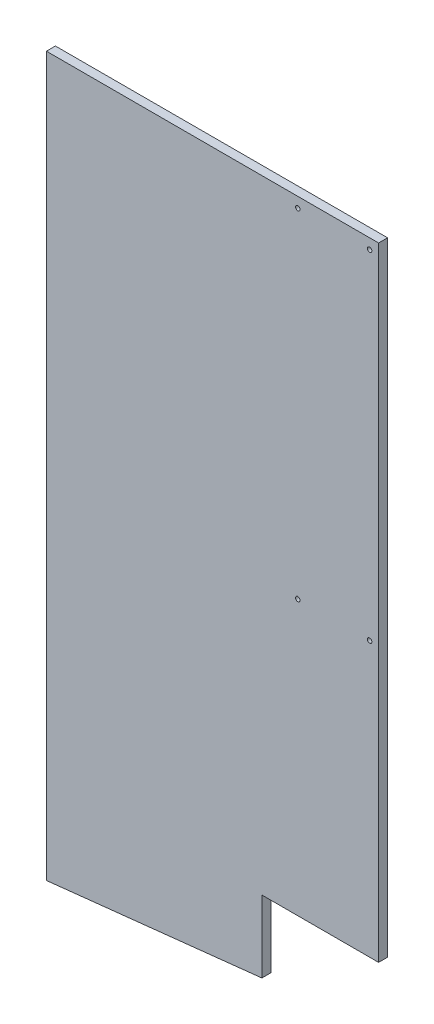
ISO-10303-21;
HEADER;
FILE_DESCRIPTION(('STEP AP214'),'2;1');
FILE_NAME('part.step','',(''),(''),'','','');
FILE_SCHEMA(('AUTOMOTIVE_DESIGN { 1 0 10303 214 1 1 1 1 }'));
ENDSEC;
DATA;
#1=APPLICATION_CONTEXT('core data for automotive mechanical design processes');
#2=APPLICATION_PROTOCOL_DEFINITION('international standard','automotive_design',2000,#1);
#3=PRODUCT_CONTEXT('',#1,'mechanical');
#4=PRODUCT('Part','Part','',(#3));
#5=PRODUCT_RELATED_PRODUCT_CATEGORY('part','',(#4));
#6=PRODUCT_DEFINITION_FORMATION('','',#4);
#7=PRODUCT_DEFINITION_CONTEXT('part definition',#1,'design');
#8=PRODUCT_DEFINITION('design','',#6,#7);
#9=PRODUCT_DEFINITION_SHAPE('','',#8);
#10=(LENGTH_UNIT() NAMED_UNIT(*) SI_UNIT(.MILLI.,.METRE.));
#11=(NAMED_UNIT(*) PLANE_ANGLE_UNIT() SI_UNIT($,.RADIAN.));
#12=(NAMED_UNIT(*) SI_UNIT($,.STERADIAN.) SOLID_ANGLE_UNIT());
#13=UNCERTAINTY_MEASURE_WITH_UNIT(LENGTH_MEASURE(1.E-05),#10,'distance_accuracy_value','');
#14=(GEOMETRIC_REPRESENTATION_CONTEXT(3) GLOBAL_UNCERTAINTY_ASSIGNED_CONTEXT((#13)) GLOBAL_UNIT_ASSIGNED_CONTEXT((#10,
#11,#12)) REPRESENTATION_CONTEXT('',''));
#15=CARTESIAN_POINT('',(0.,0.,0.));
#16=DIRECTION('',(0.,0.,1.));
#17=DIRECTION('',(1.,0.,0.));
#18=AXIS2_PLACEMENT_3D('',#15,#16,#17);
#19=CARTESIAN_POINT('',(234.95,0.,-6.35));
#20=DIRECTION('',(0.,0.,-1.));
#21=DIRECTION('',(-1.,0.,0.));
#22=AXIS2_PLACEMENT_3D('',#19,#20,#21);
#23=PLANE('',#22);
#24=CARTESIAN_POINT('',(177.8,261.2898,-6.35));
#25=DIRECTION('',(0.,0.,1.));
#26=DIRECTION('',(1.,0.,0.));
#27=AXIS2_PLACEMENT_3D('',#24,#25,#26);
#28=CIRCLE('',#27,1.5875);
#29=CARTESIAN_POINT('',(179.3875,261.2898,-6.35));
#30=VERTEX_POINT('',#29);
#31=EDGE_CURVE('E103',#30,#30,#28,.T.);
#32=ORIENTED_EDGE('',*,*,#31,.T.);
#33=EDGE_LOOP('',(#32));
#34=FACE_BOUND('',#33,.T.);
#35=CARTESIAN_POINT('',(228.6,261.2898,-6.35));
#36=DIRECTION('',(0.,0.,1.));
#37=DIRECTION('',(1.,0.,0.));
#38=AXIS2_PLACEMENT_3D('',#35,#36,#37);
#39=CIRCLE('',#38,1.5875);
#40=CARTESIAN_POINT('',(230.1875,261.2898,-6.35));
#41=VERTEX_POINT('',#40);
#42=EDGE_CURVE('E107',#41,#41,#39,.T.);
#43=ORIENTED_EDGE('',*,*,#42,.T.);
#44=EDGE_LOOP('',(#43));
#45=FACE_BOUND('',#44,.T.);
#46=CARTESIAN_POINT('',(177.8,500.7102,-6.35));
#47=DIRECTION('',(0.,0.,-1.));
#48=DIRECTION('',(-1.,0.,0.));
#49=AXIS2_PLACEMENT_3D('',#46,#47,#48);
#50=CIRCLE('',#49,1.5875);
#51=CARTESIAN_POINT('',(176.2125,500.7102,-6.35));
#52=VERTEX_POINT('',#51);
#53=EDGE_CURVE('E109',#52,#52,#50,.F.);
#54=ORIENTED_EDGE('',*,*,#53,.T.);
#55=EDGE_LOOP('',(#54));
#56=FACE_BOUND('',#55,.T.);
#57=CARTESIAN_POINT('',(228.6,500.7102,-6.35));
#58=DIRECTION('',(0.,0.,-1.));
#59=DIRECTION('',(-1.,0.,0.));
#60=AXIS2_PLACEMENT_3D('',#57,#58,#59);
#61=CIRCLE('',#60,1.5875);
#62=CARTESIAN_POINT('',(227.0125,500.7102,-6.35));
#63=VERTEX_POINT('',#62);
#64=EDGE_CURVE('E20',#63,#63,#61,.F.);
#65=ORIENTED_EDGE('',*,*,#64,.T.);
#66=EDGE_LOOP('',(#65));
#67=FACE_BOUND('',#66,.T.);
#68=DIRECTION('',(0.,1.,0.));
#69=VECTOR('',#68,1.);
#70=CARTESIAN_POINT('',(234.95,0.,-6.35));
#71=LINE('',#70,#69);
#72=CARTESIAN_POINT('',(234.95,67.31,-6.35));
#73=VERTEX_POINT('',#72);
#74=CARTESIAN_POINT('',(234.95,508.,-6.35));
#75=VERTEX_POINT('',#74);
#76=EDGE_CURVE('E73',#73,#75,#71,.T.);
#77=ORIENTED_EDGE('',*,*,#76,.F.);
#78=DIRECTION('',(1.,0.,0.));
#79=VECTOR('',#78,1.);
#80=CARTESIAN_POINT('',(234.95,67.31,-6.35));
#81=LINE('',#80,#79);
#82=CARTESIAN_POINT('',(152.4,67.31,-6.35));
#83=VERTEX_POINT('',#82);
#84=EDGE_CURVE('E116',#73,#83,#81,.F.);
#85=ORIENTED_EDGE('',*,*,#84,.T.);
#86=DIRECTION('',(0.,1.,0.));
#87=VECTOR('',#86,1.);
#88=CARTESIAN_POINT('',(152.4,67.31,-6.35));
#89=LINE('',#88,#87);
#90=CARTESIAN_POINT('',(152.4,16.4756756756745,-6.35));
#91=VERTEX_POINT('',#90);
#92=EDGE_CURVE('E125',#83,#91,#89,.F.);
#93=ORIENTED_EDGE('',*,*,#92,.T.);
#94=DIRECTION('',(-0.994207047565848,-0.107481842980105,0.));
#95=VECTOR('',#94,1.);
#96=CARTESIAN_POINT('',(234.95,25.4,-6.35));
#97=LINE('',#96,#95);
#98=CARTESIAN_POINT('',(0.,-7.89299181569447E-13,-6.35));
#99=VERTEX_POINT('',#98);
#100=EDGE_CURVE('E129',#91,#99,#97,.T.);
#101=ORIENTED_EDGE('',*,*,#100,.T.);
#102=DIRECTION('',(0.,1.,0.));
#103=VECTOR('',#102,1.);
#104=CARTESIAN_POINT('',(0.,0.,-6.35));
#105=LINE('',#104,#103);
#106=CARTESIAN_POINT('',(0.,508.,-6.35));
#107=VERTEX_POINT('',#106);
#108=EDGE_CURVE('E83',#107,#99,#105,.F.);
#109=ORIENTED_EDGE('',*,*,#108,.F.);
#110=DIRECTION('',(1.,0.,0.));
#111=VECTOR('',#110,1.);
#112=CARTESIAN_POINT('',(0.,508.,-6.35));
#113=LINE('',#112,#111);
#114=EDGE_CURVE('E68',#75,#107,#113,.F.);
#115=ORIENTED_EDGE('',*,*,#114,.F.);
#116=EDGE_LOOP('',(#77,#85,#93,#101,#109,#115));
#117=FACE_BOUND('',#116,.T.);
#118=ADVANCED_FACE('F17',(#34,#45,#56,#67,#117),#23,.T.);
#119=CARTESIAN_POINT('',(234.95,0.,0.));
#120=DIRECTION('',(1.,0.,0.));
#121=DIRECTION('',(0.,0.,-1.));
#122=AXIS2_PLACEMENT_3D('',#119,#120,#121);
#123=PLANE('',#122);
#124=DIRECTION('',(0.,1.,0.));
#125=VECTOR('',#124,1.);
#126=CARTESIAN_POINT('',(234.95,0.,0.));
#127=LINE('',#126,#125);
#128=CARTESIAN_POINT('',(234.95,67.31,0.));
#129=VERTEX_POINT('',#128);
#130=CARTESIAN_POINT('',(234.95,508.,0.));
#131=VERTEX_POINT('',#130);
#132=EDGE_CURVE('E106',#129,#131,#127,.T.);
#133=ORIENTED_EDGE('',*,*,#132,.F.);
#134=DIRECTION('',(0.,0.,1.));
#135=VECTOR('',#134,1.);
#136=CARTESIAN_POINT('',(234.95,67.31,0.));
#137=LINE('',#136,#135);
#138=EDGE_CURVE('E78',#129,#73,#137,.F.);
#139=ORIENTED_EDGE('',*,*,#138,.T.);
#140=ORIENTED_EDGE('',*,*,#76,.T.);
#141=DIRECTION('',(0.,0.,1.));
#142=VECTOR('',#141,1.);
#143=CARTESIAN_POINT('',(234.95,508.,0.));
#144=LINE('',#143,#142);
#145=EDGE_CURVE('E75',#131,#75,#144,.F.);
#146=ORIENTED_EDGE('',*,*,#145,.F.);
#147=EDGE_LOOP('',(#133,#139,#140,#146));
#148=FACE_BOUND('',#147,.T.);
#149=ADVANCED_FACE('F74',(#148),#123,.T.);
#150=CARTESIAN_POINT('',(0.,508.,0.));
#151=DIRECTION('',(0.,1.,0.));
#152=DIRECTION('',(0.,0.,1.));
#153=AXIS2_PLACEMENT_3D('',#150,#151,#152);
#154=PLANE('',#153);
#155=DIRECTION('',(0.,0.,1.));
#156=VECTOR('',#155,1.);
#157=CARTESIAN_POINT('',(0.,508.,-6.35));
#158=LINE('',#157,#156);
#159=CARTESIAN_POINT('',(0.,508.,0.));
#160=VERTEX_POINT('',#159);
#161=EDGE_CURVE('E85',#160,#107,#158,.F.);
#162=ORIENTED_EDGE('',*,*,#161,.F.);
#163=DIRECTION('',(1.,0.,0.));
#164=VECTOR('',#163,1.);
#165=CARTESIAN_POINT('',(0.,508.,0.));
#166=LINE('',#165,#164);
#167=EDGE_CURVE('E89',#131,#160,#166,.F.);
#168=ORIENTED_EDGE('',*,*,#167,.F.);
#169=ORIENTED_EDGE('',*,*,#145,.T.);
#170=ORIENTED_EDGE('',*,*,#114,.T.);
#171=EDGE_LOOP('',(#162,#168,#169,#170));
#172=FACE_BOUND('',#171,.T.);
#173=ADVANCED_FACE('F87',(#172),#154,.T.);
#174=CARTESIAN_POINT('',(0.,0.,-6.35));
#175=DIRECTION('',(-1.,0.,0.));
#176=DIRECTION('',(0.,0.,1.));
#177=AXIS2_PLACEMENT_3D('',#174,#175,#176);
#178=PLANE('',#177);
#179=ORIENTED_EDGE('',*,*,#108,.T.);
#180=DIRECTION('',(0.,0.,1.));
#181=VECTOR('',#180,1.);
#182=CARTESIAN_POINT('',(3.33066907387547E-13,-3.15719672627779E-12,0.));
#183=LINE('',#182,#181);
#184=CARTESIAN_POINT('',(0.,-7.89299181569447E-13,0.));
#185=VERTEX_POINT('',#184);
#186=EDGE_CURVE('E127',#99,#185,#183,.T.);
#187=ORIENTED_EDGE('',*,*,#186,.T.);
#188=DIRECTION('',(0.,1.,0.));
#189=VECTOR('',#188,1.);
#190=CARTESIAN_POINT('',(0.,0.,0.));
#191=LINE('',#190,#189);
#192=EDGE_CURVE('E136',#160,#185,#191,.F.);
#193=ORIENTED_EDGE('',*,*,#192,.F.);
#194=ORIENTED_EDGE('',*,*,#161,.T.);
#195=EDGE_LOOP('',(#179,#187,#193,#194));
#196=FACE_BOUND('',#195,.T.);
#197=ADVANCED_FACE('F133',(#196),#178,.T.);
#198=CARTESIAN_POINT('',(234.95,25.4,0.));
#199=DIRECTION('',(-0.107481842980105,0.994207047565848,0.));
#200=DIRECTION('',(-0.994207047565848,-0.107481842980105,0.));
#201=AXIS2_PLACEMENT_3D('',#198,#199,#200);
#202=PLANE('',#201);
#203=ORIENTED_EDGE('',*,*,#186,.F.);
#204=ORIENTED_EDGE('',*,*,#100,.F.);
#205=DIRECTION('',(0.,0.,1.));
#206=VECTOR('',#205,1.);
#207=CARTESIAN_POINT('',(152.4,16.4756756756744,0.));
#208=LINE('',#207,#206);
#209=CARTESIAN_POINT('',(152.4,16.4756756756745,0.));
#210=VERTEX_POINT('',#209);
#211=EDGE_CURVE('E123',#91,#210,#208,.T.);
#212=ORIENTED_EDGE('',*,*,#211,.T.);
#213=DIRECTION('',(0.99420704756585,0.107481842980084,0.));
#214=VECTOR('',#213,1.);
#215=CARTESIAN_POINT('',(0.,0.,0.));
#216=LINE('',#215,#214);
#217=EDGE_CURVE('E140',#185,#210,#216,.T.);
#218=ORIENTED_EDGE('',*,*,#217,.F.);
#219=EDGE_LOOP('',(#203,#204,#212,#218));
#220=FACE_BOUND('',#219,.T.);
#221=ADVANCED_FACE('F155',(#220),#202,.F.);
#222=CARTESIAN_POINT('',(152.4,67.31,0.));
#223=DIRECTION('',(-1.,0.,0.));
#224=DIRECTION('',(0.,0.,1.));
#225=AXIS2_PLACEMENT_3D('',#222,#223,#224);
#226=PLANE('',#225);
#227=ORIENTED_EDGE('',*,*,#92,.F.);
#228=DIRECTION('',(0.,0.,1.));
#229=VECTOR('',#228,1.);
#230=CARTESIAN_POINT('',(152.4,67.31,0.));
#231=LINE('',#230,#229);
#232=CARTESIAN_POINT('',(152.4,67.31,0.));
#233=VERTEX_POINT('',#232);
#234=EDGE_CURVE('E35',#83,#233,#231,.T.);
#235=ORIENTED_EDGE('',*,*,#234,.T.);
#236=DIRECTION('',(0.,1.,0.));
#237=VECTOR('',#236,1.);
#238=CARTESIAN_POINT('',(152.4,0.,0.));
#239=LINE('',#238,#237);
#240=EDGE_CURVE('E147',#210,#233,#239,.T.);
#241=ORIENTED_EDGE('',*,*,#240,.F.);
#242=ORIENTED_EDGE('',*,*,#211,.F.);
#243=EDGE_LOOP('',(#227,#235,#241,#242));
#244=FACE_BOUND('',#243,.T.);
#245=ADVANCED_FACE('F153',(#244),#226,.F.);
#246=CARTESIAN_POINT('',(234.95,67.31,0.));
#247=DIRECTION('',(0.,1.,0.));
#248=DIRECTION('',(0.,0.,1.));
#249=AXIS2_PLACEMENT_3D('',#246,#247,#248);
#250=PLANE('',#249);
#251=ORIENTED_EDGE('',*,*,#84,.F.);
#252=ORIENTED_EDGE('',*,*,#138,.F.);
#253=DIRECTION('',(1.,0.,0.));
#254=VECTOR('',#253,1.);
#255=CARTESIAN_POINT('',(0.,67.31,0.));
#256=LINE('',#255,#254);
#257=EDGE_CURVE('E102',#233,#129,#256,.T.);
#258=ORIENTED_EDGE('',*,*,#257,.F.);
#259=ORIENTED_EDGE('',*,*,#234,.F.);
#260=EDGE_LOOP('',(#251,#252,#258,#259));
#261=FACE_BOUND('',#260,.T.);
#262=ADVANCED_FACE('F150',(#261),#250,.F.);
#263=CARTESIAN_POINT('',(228.6,500.7102,0.));
#264=DIRECTION('',(0.,0.,-1.));
#265=DIRECTION('',(-1.,0.,0.));
#266=AXIS2_PLACEMENT_3D('',#263,#264,#265);
#267=CYLINDRICAL_SURFACE('',#266,1.5875);
#268=ORIENTED_EDGE('',*,*,#64,.F.);
#269=EDGE_LOOP('',(#268));
#270=FACE_BOUND('',#269,.T.);
#271=CARTESIAN_POINT('',(228.6,500.7102,0.));
#272=DIRECTION('',(0.,0.,-1.));
#273=DIRECTION('',(-1.,0.,0.));
#274=AXIS2_PLACEMENT_3D('',#271,#272,#273);
#275=CIRCLE('',#274,1.5875);
#276=CARTESIAN_POINT('',(227.0125,500.7102,0.));
#277=VERTEX_POINT('',#276);
#278=EDGE_CURVE('E99',#277,#277,#275,.T.);
#279=ORIENTED_EDGE('',*,*,#278,.F.);
#280=EDGE_LOOP('',(#279));
#281=FACE_BOUND('',#280,.T.);
#282=ADVANCED_FACE('F183',(#270,#281),#267,.F.);
#283=CARTESIAN_POINT('',(177.8,500.7102,0.));
#284=DIRECTION('',(0.,0.,-1.));
#285=DIRECTION('',(-1.,0.,0.));
#286=AXIS2_PLACEMENT_3D('',#283,#284,#285);
#287=CYLINDRICAL_SURFACE('',#286,1.5875);
#288=ORIENTED_EDGE('',*,*,#53,.F.);
#289=EDGE_LOOP('',(#288));
#290=FACE_BOUND('',#289,.T.);
#291=CARTESIAN_POINT('',(177.8,500.7102,0.));
#292=DIRECTION('',(0.,0.,-1.));
#293=DIRECTION('',(-1.,0.,0.));
#294=AXIS2_PLACEMENT_3D('',#291,#292,#293);
#295=CIRCLE('',#294,1.5875);
#296=CARTESIAN_POINT('',(176.2125,500.7102,0.));
#297=VERTEX_POINT('',#296);
#298=EDGE_CURVE('E96',#297,#297,#295,.T.);
#299=ORIENTED_EDGE('',*,*,#298,.F.);
#300=EDGE_LOOP('',(#299));
#301=FACE_BOUND('',#300,.T.);
#302=ADVANCED_FACE('F179',(#290,#301),#287,.F.);
#303=CARTESIAN_POINT('',(228.6,261.2898,0.));
#304=DIRECTION('',(0.,0.,1.));
#305=DIRECTION('',(1.,0.,0.));
#306=AXIS2_PLACEMENT_3D('',#303,#304,#305);
#307=CYLINDRICAL_SURFACE('',#306,1.5875);
#308=ORIENTED_EDGE('',*,*,#42,.F.);
#309=EDGE_LOOP('',(#308));
#310=FACE_BOUND('',#309,.T.);
#311=CARTESIAN_POINT('',(228.6,261.2898,0.));
#312=DIRECTION('',(0.,0.,1.));
#313=DIRECTION('',(1.,0.,0.));
#314=AXIS2_PLACEMENT_3D('',#311,#312,#313);
#315=CIRCLE('',#314,1.5875);
#316=CARTESIAN_POINT('',(230.1875,261.2898,0.));
#317=VERTEX_POINT('',#316);
#318=EDGE_CURVE('E26',#317,#317,#315,.F.);
#319=ORIENTED_EDGE('',*,*,#318,.F.);
#320=EDGE_LOOP('',(#319));
#321=FACE_BOUND('',#320,.T.);
#322=ADVANCED_FACE('F172',(#310,#321),#307,.F.);
#323=CARTESIAN_POINT('',(177.8,261.2898,0.));
#324=DIRECTION('',(0.,0.,1.));
#325=DIRECTION('',(1.,0.,0.));
#326=AXIS2_PLACEMENT_3D('',#323,#324,#325);
#327=CYLINDRICAL_SURFACE('',#326,1.5875);
#328=ORIENTED_EDGE('',*,*,#31,.F.);
#329=EDGE_LOOP('',(#328));
#330=FACE_BOUND('',#329,.T.);
#331=CARTESIAN_POINT('',(177.8,261.2898,0.));
#332=DIRECTION('',(0.,0.,1.));
#333=DIRECTION('',(1.,0.,0.));
#334=AXIS2_PLACEMENT_3D('',#331,#332,#333);
#335=CIRCLE('',#334,1.5875);
#336=CARTESIAN_POINT('',(179.3875,261.2898,0.));
#337=VERTEX_POINT('',#336);
#338=EDGE_CURVE('E11',#337,#337,#335,.F.);
#339=ORIENTED_EDGE('',*,*,#338,.F.);
#340=EDGE_LOOP('',(#339));
#341=FACE_BOUND('',#340,.T.);
#342=ADVANCED_FACE('F166',(#330,#341),#327,.F.);
#343=CARTESIAN_POINT('',(0.,0.,0.));
#344=DIRECTION('',(0.,0.,1.));
#345=DIRECTION('',(1.,0.,0.));
#346=AXIS2_PLACEMENT_3D('',#343,#344,#345);
#347=PLANE('',#346);
#348=ORIENTED_EDGE('',*,*,#338,.T.);
#349=EDGE_LOOP('',(#348));
#350=FACE_BOUND('',#349,.T.);
#351=ORIENTED_EDGE('',*,*,#318,.T.);
#352=EDGE_LOOP('',(#351));
#353=FACE_BOUND('',#352,.T.);
#354=ORIENTED_EDGE('',*,*,#298,.T.);
#355=EDGE_LOOP('',(#354));
#356=FACE_BOUND('',#355,.T.);
#357=ORIENTED_EDGE('',*,*,#278,.T.);
#358=EDGE_LOOP('',(#357));
#359=FACE_BOUND('',#358,.T.);
#360=ORIENTED_EDGE('',*,*,#240,.T.);
#361=ORIENTED_EDGE('',*,*,#257,.T.);
#362=ORIENTED_EDGE('',*,*,#132,.T.);
#363=ORIENTED_EDGE('',*,*,#167,.T.);
#364=ORIENTED_EDGE('',*,*,#192,.T.);
#365=ORIENTED_EDGE('',*,*,#217,.T.);
#366=EDGE_LOOP('',(#360,#361,#362,#363,#364,#365));
#367=FACE_BOUND('',#366,.T.);
#368=ADVANCED_FACE('F143',(#350,#353,#356,#359,#367),#347,.T.);
#369=CLOSED_SHELL('',(#118,#149,#173,#197,#221,#245,#262,#282,#302,#322,#342,#368));
#370=MANIFOLD_SOLID_BREP('B1',#369);
#371=ADVANCED_BREP_SHAPE_REPRESENTATION('',(#18,#370),#14);
#372=SHAPE_DEFINITION_REPRESENTATION(#9,#371);
ENDSEC;
END-ISO-10303-21;
